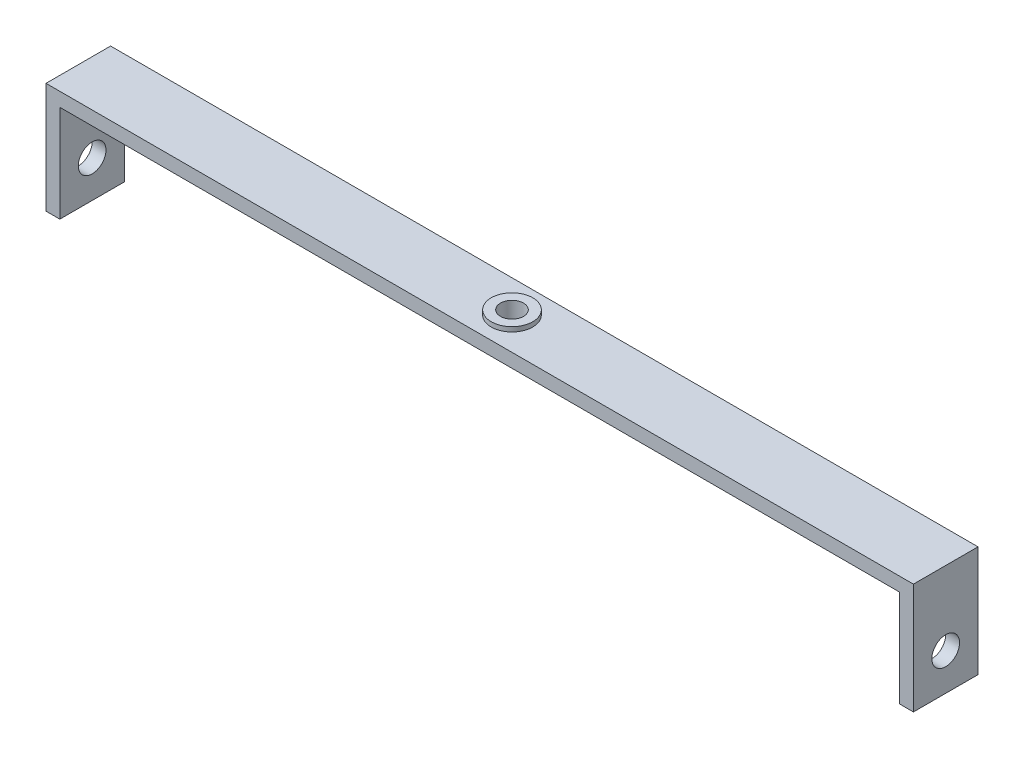
ISO-10303-21;
HEADER;
FILE_DESCRIPTION(('STEP AP214'),'2;1');
FILE_NAME('part.step','',(''),(''),'','','');
FILE_SCHEMA(('AUTOMOTIVE_DESIGN { 1 0 10303 214 1 1 1 1 }'));
ENDSEC;
DATA;
#1=APPLICATION_CONTEXT('core data for automotive mechanical design processes');
#2=APPLICATION_PROTOCOL_DEFINITION('international standard','automotive_design',2000,#1);
#3=PRODUCT_CONTEXT('',#1,'mechanical');
#4=PRODUCT('Part','Part','',(#3));
#5=PRODUCT_RELATED_PRODUCT_CATEGORY('part','',(#4));
#6=PRODUCT_DEFINITION_FORMATION('','',#4);
#7=PRODUCT_DEFINITION_CONTEXT('part definition',#1,'design');
#8=PRODUCT_DEFINITION('design','',#6,#7);
#9=PRODUCT_DEFINITION_SHAPE('','',#8);
#10=(LENGTH_UNIT() NAMED_UNIT(*) SI_UNIT(.MILLI.,.METRE.));
#11=(NAMED_UNIT(*) PLANE_ANGLE_UNIT() SI_UNIT($,.RADIAN.));
#12=(NAMED_UNIT(*) SI_UNIT($,.STERADIAN.) SOLID_ANGLE_UNIT());
#13=UNCERTAINTY_MEASURE_WITH_UNIT(LENGTH_MEASURE(1.E-05),#10,'distance_accuracy_value','');
#14=(GEOMETRIC_REPRESENTATION_CONTEXT(3) GLOBAL_UNCERTAINTY_ASSIGNED_CONTEXT((#13)) GLOBAL_UNIT_ASSIGNED_CONTEXT((#10,
#11,#12)) REPRESENTATION_CONTEXT('',''));
#15=CARTESIAN_POINT('',(0.,0.,0.));
#16=DIRECTION('',(0.,0.,1.));
#17=DIRECTION('',(1.,0.,0.));
#18=AXIS2_PLACEMENT_3D('',#15,#16,#17);
#19=CARTESIAN_POINT('',(-47.,0.,-3.5));
#20=DIRECTION('',(0.,1.,0.));
#21=DIRECTION('',(-1.,0.,0.));
#22=AXIS2_PLACEMENT_3D('',#19,#20,#21);
#23=PLANE('',#22);
#24=DIRECTION('',(0.,0.,1.));
#25=VECTOR('',#24,1.);
#26=CARTESIAN_POINT('',(-47.,0.,-3.5));
#27=LINE('',#26,#25);
#28=CARTESIAN_POINT('',(-47.,0.,-3.5));
#29=VERTEX_POINT('',#28);
#30=CARTESIAN_POINT('',(-47.,0.,3.5));
#31=VERTEX_POINT('',#30);
#32=EDGE_CURVE('E11',#29,#31,#27,.T.);
#33=ORIENTED_EDGE('',*,*,#32,.T.);
#34=DIRECTION('',(-1.,0.,0.));
#35=VECTOR('',#34,1.);
#36=CARTESIAN_POINT('',(-47.,0.,3.5));
#37=LINE('',#36,#35);
#38=CARTESIAN_POINT('',(47.,0.,3.5));
#39=VERTEX_POINT('',#38);
#40=EDGE_CURVE('E127',#39,#31,#37,.T.);
#41=ORIENTED_EDGE('',*,*,#40,.F.);
#42=DIRECTION('',(0.,0.,1.));
#43=VECTOR('',#42,1.);
#44=CARTESIAN_POINT('',(47.,0.,-3.5));
#45=LINE('',#44,#43);
#46=CARTESIAN_POINT('',(47.,0.,-3.5));
#47=VERTEX_POINT('',#46);
#48=EDGE_CURVE('E49',#47,#39,#45,.T.);
#49=ORIENTED_EDGE('',*,*,#48,.F.);
#50=DIRECTION('',(-1.,0.,0.));
#51=VECTOR('',#50,1.);
#52=CARTESIAN_POINT('',(-47.,0.,-3.5));
#53=LINE('',#52,#51);
#54=EDGE_CURVE('E113',#47,#29,#53,.T.);
#55=ORIENTED_EDGE('',*,*,#54,.T.);
#56=EDGE_LOOP('',(#33,#41,#49,#55));
#57=FACE_BOUND('',#56,.T.);
#58=CARTESIAN_POINT('',(0.,0.,0.));
#59=DIRECTION('',(0.,1.,0.));
#60=DIRECTION('',(-1.,0.,0.));
#61=AXIS2_PLACEMENT_3D('',#58,#59,#60);
#62=CIRCLE('',#61,2.25);
#63=CARTESIAN_POINT('',(-2.25,0.,0.));
#64=VERTEX_POINT('',#63);
#65=EDGE_CURVE('E136',#64,#64,#62,.T.);
#66=ORIENTED_EDGE('',*,*,#65,.F.);
#67=EDGE_LOOP('',(#66));
#68=FACE_BOUND('',#67,.T.);
#69=ADVANCED_FACE('F39',(#57,#68),#23,.T.);
#70=CARTESIAN_POINT('',(-47.,-12.,-3.5));
#71=DIRECTION('',(-1.,0.,0.));
#72=DIRECTION('',(0.,0.,1.));
#73=AXIS2_PLACEMENT_3D('',#70,#71,#72);
#74=PLANE('',#73);
#75=CARTESIAN_POINT('',(-47.,-8.,0.));
#76=DIRECTION('',(-1.,0.,0.));
#77=DIRECTION('',(0.,0.,1.));
#78=AXIS2_PLACEMENT_3D('',#75,#76,#77);
#79=CIRCLE('',#78,1.5);
#80=CARTESIAN_POINT('',(-47.,-8.,1.5));
#81=VERTEX_POINT('',#80);
#82=EDGE_CURVE('E215',#81,#81,#79,.F.);
#83=ORIENTED_EDGE('',*,*,#82,.T.);
#84=EDGE_LOOP('',(#83));
#85=FACE_BOUND('',#84,.T.);
#86=DIRECTION('',(0.,0.,1.));
#87=VECTOR('',#86,1.);
#88=CARTESIAN_POINT('',(-47.,-12.,-3.5));
#89=LINE('',#88,#87);
#90=CARTESIAN_POINT('',(-47.,-12.,-3.5));
#91=VERTEX_POINT('',#90);
#92=CARTESIAN_POINT('',(-47.,-12.,3.5));
#93=VERTEX_POINT('',#92);
#94=EDGE_CURVE('E103',#91,#93,#89,.T.);
#95=ORIENTED_EDGE('',*,*,#94,.T.);
#96=DIRECTION('',(0.,-1.,0.));
#97=VECTOR('',#96,1.);
#98=CARTESIAN_POINT('',(-47.,-12.,3.5));
#99=LINE('',#98,#97);
#100=EDGE_CURVE('E106',#31,#93,#99,.T.);
#101=ORIENTED_EDGE('',*,*,#100,.F.);
#102=ORIENTED_EDGE('',*,*,#32,.F.);
#103=DIRECTION('',(0.,-1.,0.));
#104=VECTOR('',#103,1.);
#105=CARTESIAN_POINT('',(-47.,-12.,-3.5));
#106=LINE('',#105,#104);
#107=EDGE_CURVE('E107',#29,#91,#106,.T.);
#108=ORIENTED_EDGE('',*,*,#107,.T.);
#109=EDGE_LOOP('',(#95,#101,#102,#108));
#110=FACE_BOUND('',#109,.T.);
#111=ADVANCED_FACE('F41',(#85,#110),#74,.T.);
#112=CARTESIAN_POINT('',(47.,0.,-3.5));
#113=DIRECTION('',(1.,0.,0.));
#114=DIRECTION('',(0.,0.,-1.));
#115=AXIS2_PLACEMENT_3D('',#112,#113,#114);
#116=PLANE('',#115);
#117=CARTESIAN_POINT('',(47.,-8.,0.));
#118=DIRECTION('',(1.,0.,0.));
#119=DIRECTION('',(0.,0.,-1.));
#120=AXIS2_PLACEMENT_3D('',#117,#118,#119);
#121=CIRCLE('',#120,1.5);
#122=CARTESIAN_POINT('',(47.,-8.,-1.5));
#123=VERTEX_POINT('',#122);
#124=EDGE_CURVE('E202',#123,#123,#121,.T.);
#125=ORIENTED_EDGE('',*,*,#124,.F.);
#126=EDGE_LOOP('',(#125));
#127=FACE_BOUND('',#126,.T.);
#128=ORIENTED_EDGE('',*,*,#48,.T.);
#129=DIRECTION('',(0.,1.,0.));
#130=VECTOR('',#129,1.);
#131=CARTESIAN_POINT('',(47.,0.,3.5));
#132=LINE('',#131,#130);
#133=CARTESIAN_POINT('',(47.,-12.,3.5));
#134=VERTEX_POINT('',#133);
#135=EDGE_CURVE('E153',#134,#39,#132,.T.);
#136=ORIENTED_EDGE('',*,*,#135,.F.);
#137=DIRECTION('',(0.,0.,1.));
#138=VECTOR('',#137,1.);
#139=CARTESIAN_POINT('',(47.,-12.,-3.5));
#140=LINE('',#139,#138);
#141=CARTESIAN_POINT('',(47.,-12.,-3.5));
#142=VERTEX_POINT('',#141);
#143=EDGE_CURVE('E185',#142,#134,#140,.T.);
#144=ORIENTED_EDGE('',*,*,#143,.F.);
#145=DIRECTION('',(0.,1.,0.));
#146=VECTOR('',#145,1.);
#147=CARTESIAN_POINT('',(47.,0.,-3.5));
#148=LINE('',#147,#146);
#149=EDGE_CURVE('E178',#142,#47,#148,.T.);
#150=ORIENTED_EDGE('',*,*,#149,.T.);
#151=EDGE_LOOP('',(#128,#136,#144,#150));
#152=FACE_BOUND('',#151,.T.);
#153=ADVANCED_FACE('F232',(#127,#152),#116,.T.);
#154=CARTESIAN_POINT('',(47.,-12.,-3.5));
#155=DIRECTION('',(0.,-1.,0.));
#156=DIRECTION('',(1.,0.,0.));
#157=AXIS2_PLACEMENT_3D('',#154,#155,#156);
#158=PLANE('',#157);
#159=ORIENTED_EDGE('',*,*,#143,.T.);
#160=DIRECTION('',(1.,0.,0.));
#161=VECTOR('',#160,1.);
#162=CARTESIAN_POINT('',(45.5,-12.,3.5));
#163=LINE('',#162,#161);
#164=CARTESIAN_POINT('',(45.5,-12.,3.5));
#165=VERTEX_POINT('',#164);
#166=EDGE_CURVE('E149',#165,#134,#163,.T.);
#167=ORIENTED_EDGE('',*,*,#166,.F.);
#168=DIRECTION('',(0.,0.,1.));
#169=VECTOR('',#168,1.);
#170=CARTESIAN_POINT('',(45.5,-12.,-3.5));
#171=LINE('',#170,#169);
#172=CARTESIAN_POINT('',(45.5,-12.,-3.5));
#173=VERTEX_POINT('',#172);
#174=EDGE_CURVE('E188',#173,#165,#171,.T.);
#175=ORIENTED_EDGE('',*,*,#174,.F.);
#176=DIRECTION('',(1.,0.,0.));
#177=VECTOR('',#176,1.);
#178=CARTESIAN_POINT('',(45.5,-12.,-3.5));
#179=LINE('',#178,#177);
#180=EDGE_CURVE('E175',#173,#142,#179,.T.);
#181=ORIENTED_EDGE('',*,*,#180,.T.);
#182=EDGE_LOOP('',(#159,#167,#175,#181));
#183=FACE_BOUND('',#182,.T.);
#184=ADVANCED_FACE('F240',(#183),#158,.T.);
#185=CARTESIAN_POINT('',(45.5,-1.5,-3.5));
#186=DIRECTION('',(-1.,0.,0.));
#187=DIRECTION('',(0.,0.,1.));
#188=AXIS2_PLACEMENT_3D('',#185,#186,#187);
#189=PLANE('',#188);
#190=CARTESIAN_POINT('',(45.5,-8.,0.));
#191=DIRECTION('',(-1.,0.,0.));
#192=DIRECTION('',(0.,0.,1.));
#193=AXIS2_PLACEMENT_3D('',#190,#191,#192);
#194=CIRCLE('',#193,1.5);
#195=CARTESIAN_POINT('',(45.5,-8.,1.5));
#196=VERTEX_POINT('',#195);
#197=EDGE_CURVE('E198',#196,#196,#194,.F.);
#198=ORIENTED_EDGE('',*,*,#197,.T.);
#199=EDGE_LOOP('',(#198));
#200=FACE_BOUND('',#199,.T.);
#201=ORIENTED_EDGE('',*,*,#174,.T.);
#202=DIRECTION('',(0.,-1.,0.));
#203=VECTOR('',#202,1.);
#204=CARTESIAN_POINT('',(45.5,-1.5,3.5));
#205=LINE('',#204,#203);
#206=CARTESIAN_POINT('',(45.5,-1.5,3.5));
#207=VERTEX_POINT('',#206);
#208=EDGE_CURVE('E145',#207,#165,#205,.T.);
#209=ORIENTED_EDGE('',*,*,#208,.F.);
#210=DIRECTION('',(0.,0.,1.));
#211=VECTOR('',#210,1.);
#212=CARTESIAN_POINT('',(45.5,-1.5,-3.5));
#213=LINE('',#212,#211);
#214=CARTESIAN_POINT('',(45.5,-1.5,-3.5));
#215=VERTEX_POINT('',#214);
#216=EDGE_CURVE('E191',#215,#207,#213,.T.);
#217=ORIENTED_EDGE('',*,*,#216,.F.);
#218=DIRECTION('',(0.,-1.,0.));
#219=VECTOR('',#218,1.);
#220=CARTESIAN_POINT('',(45.5,-1.5,-3.5));
#221=LINE('',#220,#219);
#222=EDGE_CURVE('E171',#215,#173,#221,.T.);
#223=ORIENTED_EDGE('',*,*,#222,.T.);
#224=EDGE_LOOP('',(#201,#209,#217,#223));
#225=FACE_BOUND('',#224,.T.);
#226=ADVANCED_FACE('F244',(#200,#225),#189,.T.);
#227=CARTESIAN_POINT('',(-45.5,-1.5,-3.5));
#228=DIRECTION('',(0.,-1.,0.));
#229=DIRECTION('',(0.,0.,-1.));
#230=AXIS2_PLACEMENT_3D('',#227,#228,#229);
#231=PLANE('',#230);
#232=CARTESIAN_POINT('',(0.,-1.5,0.));
#233=DIRECTION('',(0.,-1.,0.));
#234=DIRECTION('',(0.,0.,-1.));
#235=AXIS2_PLACEMENT_3D('',#232,#233,#234);
#236=CIRCLE('',#235,1.25);
#237=CARTESIAN_POINT('',(0.,-1.5,-1.25));
#238=VERTEX_POINT('',#237);
#239=EDGE_CURVE('E129',#238,#238,#236,.T.);
#240=ORIENTED_EDGE('',*,*,#239,.F.);
#241=EDGE_LOOP('',(#240));
#242=FACE_BOUND('',#241,.T.);
#243=ORIENTED_EDGE('',*,*,#216,.T.);
#244=DIRECTION('',(1.,0.,0.));
#245=VECTOR('',#244,1.);
#246=CARTESIAN_POINT('',(-45.5,-1.5,3.5));
#247=LINE('',#246,#245);
#248=CARTESIAN_POINT('',(-45.5,-1.5,3.5));
#249=VERTEX_POINT('',#248);
#250=EDGE_CURVE('E141',#249,#207,#247,.T.);
#251=ORIENTED_EDGE('',*,*,#250,.F.);
#252=DIRECTION('',(0.,0.,1.));
#253=VECTOR('',#252,1.);
#254=CARTESIAN_POINT('',(-45.5,-1.5,-3.5));
#255=LINE('',#254,#253);
#256=CARTESIAN_POINT('',(-45.5,-1.5,-3.5));
#257=VERTEX_POINT('',#256);
#258=EDGE_CURVE('E194',#257,#249,#255,.T.);
#259=ORIENTED_EDGE('',*,*,#258,.F.);
#260=DIRECTION('',(1.,0.,0.));
#261=VECTOR('',#260,1.);
#262=CARTESIAN_POINT('',(-45.5,-1.5,-3.5));
#263=LINE('',#262,#261);
#264=EDGE_CURVE('E167',#257,#215,#263,.T.);
#265=ORIENTED_EDGE('',*,*,#264,.T.);
#266=EDGE_LOOP('',(#243,#251,#259,#265));
#267=FACE_BOUND('',#266,.T.);
#268=ADVANCED_FACE('F248',(#242,#267),#231,.T.);
#269=CARTESIAN_POINT('',(-45.5,-12.,-3.5));
#270=DIRECTION('',(1.,0.,0.));
#271=DIRECTION('',(0.,0.,-1.));
#272=AXIS2_PLACEMENT_3D('',#269,#270,#271);
#273=PLANE('',#272);
#274=CARTESIAN_POINT('',(-45.5,-8.,0.));
#275=DIRECTION('',(1.,0.,0.));
#276=DIRECTION('',(0.,0.,-1.));
#277=AXIS2_PLACEMENT_3D('',#274,#275,#276);
#278=CIRCLE('',#277,1.5);
#279=CARTESIAN_POINT('',(-45.5,-8.,-1.5));
#280=VERTEX_POINT('',#279);
#281=EDGE_CURVE('E43',#280,#280,#278,.T.);
#282=ORIENTED_EDGE('',*,*,#281,.F.);
#283=EDGE_LOOP('',(#282));
#284=FACE_BOUND('',#283,.T.);
#285=ORIENTED_EDGE('',*,*,#258,.T.);
#286=DIRECTION('',(0.,1.,0.));
#287=VECTOR('',#286,1.);
#288=CARTESIAN_POINT('',(-45.5,-12.,3.5));
#289=LINE('',#288,#287);
#290=CARTESIAN_POINT('',(-45.5,-12.,3.5));
#291=VERTEX_POINT('',#290);
#292=EDGE_CURVE('E122',#291,#249,#289,.T.);
#293=ORIENTED_EDGE('',*,*,#292,.F.);
#294=DIRECTION('',(0.,0.,1.));
#295=VECTOR('',#294,1.);
#296=CARTESIAN_POINT('',(-45.5,-12.,-3.5));
#297=LINE('',#296,#295);
#298=CARTESIAN_POINT('',(-45.5,-12.,-3.5));
#299=VERTEX_POINT('',#298);
#300=EDGE_CURVE('E112',#299,#291,#297,.T.);
#301=ORIENTED_EDGE('',*,*,#300,.F.);
#302=DIRECTION('',(0.,1.,0.));
#303=VECTOR('',#302,1.);
#304=CARTESIAN_POINT('',(-45.5,-12.,-3.5));
#305=LINE('',#304,#303);
#306=EDGE_CURVE('E163',#299,#257,#305,.T.);
#307=ORIENTED_EDGE('',*,*,#306,.T.);
#308=EDGE_LOOP('',(#285,#293,#301,#307));
#309=FACE_BOUND('',#308,.T.);
#310=ADVANCED_FACE('F251',(#284,#309),#273,.T.);
#311=CARTESIAN_POINT('',(-47.,-12.,-3.5));
#312=DIRECTION('',(0.,-1.,0.));
#313=DIRECTION('',(0.,0.,-1.));
#314=AXIS2_PLACEMENT_3D('',#311,#312,#313);
#315=PLANE('',#314);
#316=ORIENTED_EDGE('',*,*,#300,.T.);
#317=DIRECTION('',(1.,0.,0.));
#318=VECTOR('',#317,1.);
#319=CARTESIAN_POINT('',(-47.,-12.,3.5));
#320=LINE('',#319,#318);
#321=EDGE_CURVE('E116',#93,#291,#320,.T.);
#322=ORIENTED_EDGE('',*,*,#321,.F.);
#323=ORIENTED_EDGE('',*,*,#94,.F.);
#324=DIRECTION('',(1.,0.,0.));
#325=VECTOR('',#324,1.);
#326=CARTESIAN_POINT('',(-47.,-12.,-3.5));
#327=LINE('',#326,#325);
#328=EDGE_CURVE('E160',#91,#299,#327,.T.);
#329=ORIENTED_EDGE('',*,*,#328,.T.);
#330=EDGE_LOOP('',(#316,#322,#323,#329));
#331=FACE_BOUND('',#330,.T.);
#332=ADVANCED_FACE('F117',(#331),#315,.T.);
#333=CARTESIAN_POINT('',(0.,0.,-3.5));
#334=DIRECTION('',(0.,0.,-1.));
#335=DIRECTION('',(-1.,0.,0.));
#336=AXIS2_PLACEMENT_3D('',#333,#334,#335);
#337=PLANE('',#336);
#338=ORIENTED_EDGE('',*,*,#107,.F.);
#339=ORIENTED_EDGE('',*,*,#54,.F.);
#340=ORIENTED_EDGE('',*,*,#149,.F.);
#341=ORIENTED_EDGE('',*,*,#180,.F.);
#342=ORIENTED_EDGE('',*,*,#222,.F.);
#343=ORIENTED_EDGE('',*,*,#264,.F.);
#344=ORIENTED_EDGE('',*,*,#306,.F.);
#345=ORIENTED_EDGE('',*,*,#328,.F.);
#346=EDGE_LOOP('',(#338,#339,#340,#341,#342,#343,#344,#345));
#347=FACE_BOUND('',#346,.T.);
#348=ADVANCED_FACE('F236',(#347),#337,.T.);
#349=CARTESIAN_POINT('',(0.,0.,3.5));
#350=DIRECTION('',(0.,0.,-1.));
#351=DIRECTION('',(-1.,0.,0.));
#352=AXIS2_PLACEMENT_3D('',#349,#350,#351);
#353=PLANE('',#352);
#354=ORIENTED_EDGE('',*,*,#100,.T.);
#355=ORIENTED_EDGE('',*,*,#321,.T.);
#356=ORIENTED_EDGE('',*,*,#292,.T.);
#357=ORIENTED_EDGE('',*,*,#250,.T.);
#358=ORIENTED_EDGE('',*,*,#208,.T.);
#359=ORIENTED_EDGE('',*,*,#166,.T.);
#360=ORIENTED_EDGE('',*,*,#135,.T.);
#361=ORIENTED_EDGE('',*,*,#40,.T.);
#362=EDGE_LOOP('',(#354,#355,#356,#357,#358,#359,#360,#361));
#363=FACE_BOUND('',#362,.T.);
#364=ADVANCED_FACE('F125',(#363),#353,.F.);
#365=CARTESIAN_POINT('',(0.,-3.5,0.));
#366=DIRECTION('',(0.,1.,0.));
#367=DIRECTION('',(-1.,0.,0.));
#368=AXIS2_PLACEMENT_3D('',#365,#366,#367);
#369=CYLINDRICAL_SURFACE('',#368,1.25);
#370=ORIENTED_EDGE('',*,*,#239,.T.);
#371=EDGE_LOOP('',(#370));
#372=FACE_BOUND('',#371,.T.);
#373=CARTESIAN_POINT('',(0.,0.5,0.));
#374=DIRECTION('',(0.,1.,0.));
#375=DIRECTION('',(-1.,0.,0.));
#376=AXIS2_PLACEMENT_3D('',#373,#374,#375);
#377=CIRCLE('',#376,1.25);
#378=CARTESIAN_POINT('',(-1.25,0.5,0.));
#379=VERTEX_POINT('',#378);
#380=EDGE_CURVE('E201',#379,#379,#377,.T.);
#381=ORIENTED_EDGE('',*,*,#380,.T.);
#382=EDGE_LOOP('',(#381));
#383=FACE_BOUND('',#382,.T.);
#384=ADVANCED_FACE('F263',(#372,#383),#369,.F.);
#385=CARTESIAN_POINT('',(0.,0.5,0.));
#386=DIRECTION('',(0.,1.,0.));
#387=DIRECTION('',(-1.,0.,0.));
#388=AXIS2_PLACEMENT_3D('',#385,#386,#387);
#389=PLANE('',#388);
#390=CARTESIAN_POINT('',(0.,0.5,0.));
#391=DIRECTION('',(0.,1.,0.));
#392=DIRECTION('',(-1.,0.,0.));
#393=AXIS2_PLACEMENT_3D('',#390,#391,#392);
#394=CIRCLE('',#393,2.25);
#395=CARTESIAN_POINT('',(-2.25,0.5,0.));
#396=VERTEX_POINT('',#395);
#397=EDGE_CURVE('E133',#396,#396,#394,.T.);
#398=ORIENTED_EDGE('',*,*,#397,.T.);
#399=EDGE_LOOP('',(#398));
#400=FACE_BOUND('',#399,.T.);
#401=ORIENTED_EDGE('',*,*,#380,.F.);
#402=EDGE_LOOP('',(#401));
#403=FACE_BOUND('',#402,.T.);
#404=ADVANCED_FACE('F282',(#400,#403),#389,.T.);
#405=CARTESIAN_POINT('',(0.,0.5,0.));
#406=DIRECTION('',(0.,-1.,0.));
#407=DIRECTION('',(1.,0.,0.));
#408=AXIS2_PLACEMENT_3D('',#405,#406,#407);
#409=CYLINDRICAL_SURFACE('',#408,2.25);
#410=ORIENTED_EDGE('',*,*,#397,.F.);
#411=EDGE_LOOP('',(#410));
#412=FACE_BOUND('',#411,.T.);
#413=ORIENTED_EDGE('',*,*,#65,.T.);
#414=EDGE_LOOP('',(#413));
#415=FACE_BOUND('',#414,.T.);
#416=ADVANCED_FACE('F225',(#412,#415),#409,.T.);
#417=CARTESIAN_POINT('',(51.2426406871193,-8.,0.));
#418=DIRECTION('',(-1.,0.,0.));
#419=DIRECTION('',(0.,0.,1.));
#420=AXIS2_PLACEMENT_3D('',#417,#418,#419);
#421=CYLINDRICAL_SURFACE('',#420,1.5);
#422=ORIENTED_EDGE('',*,*,#197,.F.);
#423=EDGE_LOOP('',(#422));
#424=FACE_BOUND('',#423,.T.);
#425=ORIENTED_EDGE('',*,*,#124,.T.);
#426=EDGE_LOOP('',(#425));
#427=FACE_BOUND('',#426,.T.);
#428=ADVANCED_FACE('F288',(#424,#427),#421,.F.);
#429=CARTESIAN_POINT('',(-51.2426406871193,-8.,0.));
#430=DIRECTION('',(1.,0.,0.));
#431=DIRECTION('',(0.,0.,-1.));
#432=AXIS2_PLACEMENT_3D('',#429,#430,#431);
#433=CYLINDRICAL_SURFACE('',#432,1.5);
#434=ORIENTED_EDGE('',*,*,#281,.T.);
#435=EDGE_LOOP('',(#434));
#436=FACE_BOUND('',#435,.T.);
#437=ORIENTED_EDGE('',*,*,#82,.F.);
#438=EDGE_LOOP('',(#437));
#439=FACE_BOUND('',#438,.T.);
#440=ADVANCED_FACE('F294',(#436,#439),#433,.F.);
#441=CLOSED_SHELL('',(#69,#111,#153,#184,#226,#268,#310,#332,#348,#364,#384,#404,#416,#428,#440));
#442=MANIFOLD_SOLID_BREP('B2',#441);
#443=ADVANCED_BREP_SHAPE_REPRESENTATION('',(#18,#442),#14);
#444=SHAPE_DEFINITION_REPRESENTATION(#9,#443);
ENDSEC;
END-ISO-10303-21;
